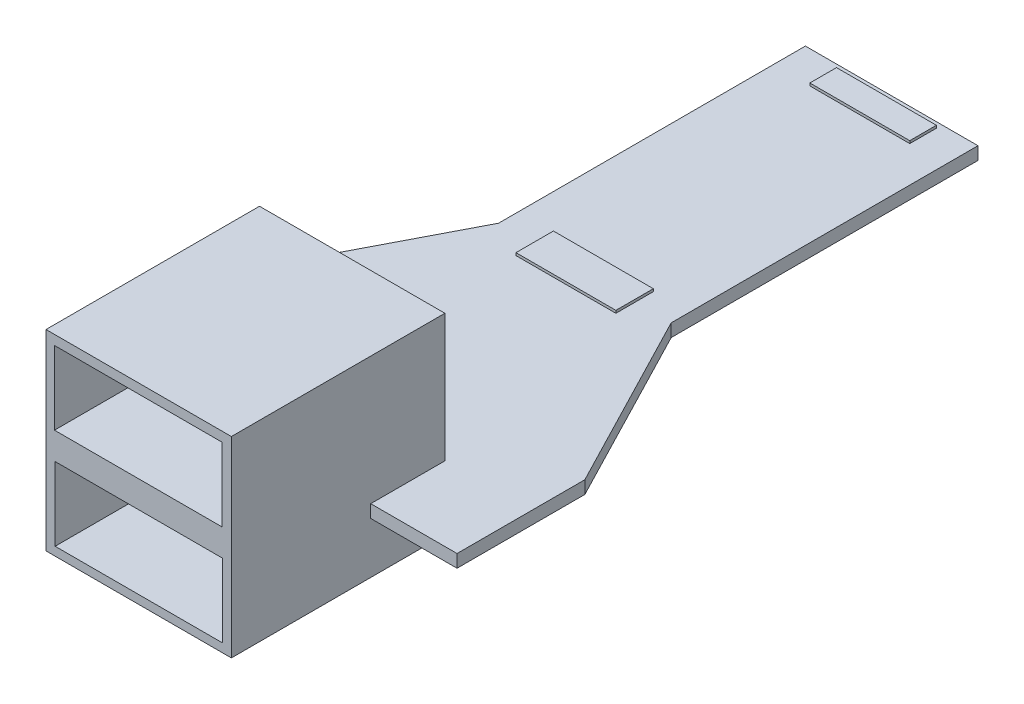
ISO-10303-21;
HEADER;
FILE_DESCRIPTION(('STEP AP214'),'2;1');
FILE_NAME('part.step','',(''),(''),'','','');
FILE_SCHEMA(('AUTOMOTIVE_DESIGN { 1 0 10303 214 1 1 1 1 }'));
ENDSEC;
DATA;
#1=APPLICATION_CONTEXT('core data for automotive mechanical design processes');
#2=APPLICATION_PROTOCOL_DEFINITION('international standard','automotive_design',2000,#1);
#3=PRODUCT_CONTEXT('',#1,'mechanical');
#4=PRODUCT('Part','Part','',(#3));
#5=PRODUCT_RELATED_PRODUCT_CATEGORY('part','',(#4));
#6=PRODUCT_DEFINITION_FORMATION('','',#4);
#7=PRODUCT_DEFINITION_CONTEXT('part definition',#1,'design');
#8=PRODUCT_DEFINITION('design','',#6,#7);
#9=PRODUCT_DEFINITION_SHAPE('','',#8);
#10=(LENGTH_UNIT() NAMED_UNIT(*) SI_UNIT(.MILLI.,.METRE.));
#11=(NAMED_UNIT(*) PLANE_ANGLE_UNIT() SI_UNIT($,.RADIAN.));
#12=(NAMED_UNIT(*) SI_UNIT($,.STERADIAN.) SOLID_ANGLE_UNIT());
#13=UNCERTAINTY_MEASURE_WITH_UNIT(LENGTH_MEASURE(1.E-05),#10,'distance_accuracy_value','');
#14=(GEOMETRIC_REPRESENTATION_CONTEXT(3) GLOBAL_UNCERTAINTY_ASSIGNED_CONTEXT((#13)) GLOBAL_UNIT_ASSIGNED_CONTEXT((#10,
#11,#12)) REPRESENTATION_CONTEXT('',''));
#15=CARTESIAN_POINT('',(0.,0.,0.));
#16=DIRECTION('',(0.,0.,1.));
#17=DIRECTION('',(1.,0.,0.));
#18=AXIS2_PLACEMENT_3D('',#15,#16,#17);
#19=CARTESIAN_POINT('',(0.,1.,0.));
#20=DIRECTION('',(0.,1.,0.));
#21=DIRECTION('',(0.,0.,1.));
#22=AXIS2_PLACEMENT_3D('',#19,#20,#21);
#23=PLANE('',#22);
#24=DIRECTION('',(0.,0.,1.));
#25=VECTOR('',#24,1.);
#26=CARTESIAN_POINT('',(-5.39699570815451,1.,0.));
#27=LINE('',#26,#25);
#28=CARTESIAN_POINT('',(-5.39699570815451,1.,2.45751072961373));
#29=VERTEX_POINT('',#28);
#30=CARTESIAN_POINT('',(-5.39699570815451,1.,8.25751072961373));
#31=VERTEX_POINT('',#30);
#32=EDGE_CURVE('E410',#29,#31,#27,.T.);
#33=ORIENTED_EDGE('',*,*,#32,.F.);
#34=DIRECTION('',(-1.,0.,0.));
#35=VECTOR('',#34,1.);
#36=CARTESIAN_POINT('',(0.,1.,2.45751072961373));
#37=LINE('',#36,#35);
#38=CARTESIAN_POINT('',(9.10300429184549,1.,2.45751072961373));
#39=VERTEX_POINT('',#38);
#40=EDGE_CURVE('E405',#39,#29,#37,.T.);
#41=ORIENTED_EDGE('',*,*,#40,.F.);
#42=DIRECTION('',(0.,0.,-1.));
#43=VECTOR('',#42,1.);
#44=CARTESIAN_POINT('',(9.10300429184549,1.,0.));
#45=LINE('',#44,#43);
#46=CARTESIAN_POINT('',(9.10300429184549,1.,8.25751072961373));
#47=VERTEX_POINT('',#46);
#48=EDGE_CURVE('E403',#47,#39,#45,.T.);
#49=ORIENTED_EDGE('',*,*,#48,.F.);
#50=DIRECTION('',(1.,0.,0.));
#51=VECTOR('',#50,1.);
#52=CARTESIAN_POINT('',(0.,1.,8.25751072961373));
#53=LINE('',#52,#51);
#54=CARTESIAN_POINT('',(15.8530042918455,1.,8.25751072961373));
#55=VERTEX_POINT('',#54);
#56=EDGE_CURVE('E429',#47,#55,#53,.T.);
#57=ORIENTED_EDGE('',*,*,#56,.T.);
#58=DIRECTION('',(0.,0.,1.));
#59=VECTOR('',#58,1.);
#60=CARTESIAN_POINT('',(15.8530042918455,1.,0.));
#61=LINE('',#60,#59);
#62=CARTESIAN_POINT('',(15.8530042918455,1.,-1.74248927038627));
#63=VERTEX_POINT('',#62);
#64=EDGE_CURVE('E433',#63,#55,#61,.T.);
#65=ORIENTED_EDGE('',*,*,#64,.F.);
#66=DIRECTION('',(0.459854247661453,0.,0.887994409277288));
#67=VECTOR('',#66,1.);
#68=CARTESIAN_POINT('',(13.2121760207027,1.,-6.84201972500677));
#69=LINE('',#68,#67);
#70=CARTESIAN_POINT('',(8.60300429184549,1.,-15.7424892703863));
#71=VERTEX_POINT('',#70);
#72=EDGE_CURVE('E413',#71,#63,#69,.T.);
#73=ORIENTED_EDGE('',*,*,#72,.F.);
#74=DIRECTION('',(0.,0.,1.));
#75=VECTOR('',#74,1.);
#76=CARTESIAN_POINT('',(8.6030042918455,1.,0.));
#77=LINE('',#76,#75);
#78=CARTESIAN_POINT('',(8.60300429184549,1.,-39.7424892703863));
#79=VERTEX_POINT('',#78);
#80=EDGE_CURVE('E416',#79,#71,#77,.T.);
#81=ORIENTED_EDGE('',*,*,#80,.F.);
#82=DIRECTION('',(1.,0.,0.));
#83=VECTOR('',#82,1.);
#84=CARTESIAN_POINT('',(0.,1.,-39.7424892703863));
#85=LINE('',#84,#83);
#86=CARTESIAN_POINT('',(-4.89699570815451,1.,-39.7424892703863));
#87=VERTEX_POINT('',#86);
#88=EDGE_CURVE('E420',#87,#79,#85,.T.);
#89=ORIENTED_EDGE('',*,*,#88,.F.);
#90=DIRECTION('',(0.,0.,1.));
#91=VECTOR('',#90,1.);
#92=CARTESIAN_POINT('',(-4.89699570815451,1.,0.));
#93=LINE('',#92,#91);
#94=CARTESIAN_POINT('',(-4.89699570815451,1.,-15.7424892703863));
#95=VERTEX_POINT('',#94);
#96=EDGE_CURVE('E423',#87,#95,#93,.T.);
#97=ORIENTED_EDGE('',*,*,#96,.T.);
#98=DIRECTION('',(-0.459854247661453,0.,0.887994409277288));
#99=VECTOR('',#98,1.);
#100=CARTESIAN_POINT('',(-10.2898619853859,1.,-5.32867852814628));
#101=LINE('',#100,#99);
#102=CARTESIAN_POINT('',(-12.1469957081545,1.,-1.74248927038627));
#103=VERTEX_POINT('',#102);
#104=EDGE_CURVE('E425',#95,#103,#101,.T.);
#105=ORIENTED_EDGE('',*,*,#104,.T.);
#106=DIRECTION('',(0.,0.,1.));
#107=VECTOR('',#106,1.);
#108=CARTESIAN_POINT('',(-12.1469957081545,1.,0.));
#109=LINE('',#108,#107);
#110=CARTESIAN_POINT('',(-12.1469957081545,1.,8.25751072961373));
#111=VERTEX_POINT('',#110);
#112=EDGE_CURVE('E427',#103,#111,#109,.T.);
#113=ORIENTED_EDGE('',*,*,#112,.T.);
#114=EDGE_CURVE('E430',#111,#31,#53,.T.);
#115=ORIENTED_EDGE('',*,*,#114,.T.);
#116=EDGE_LOOP('',(#33,#41,#49,#57,#65,#73,#81,#89,#97,#105,#113,#115));
#117=FACE_BOUND('',#116,.T.);
#118=DIRECTION('',(1.,0.,0.));
#119=VECTOR('',#118,1.);
#120=CARTESIAN_POINT('',(-2.02174192017821,1.,-14.2276042435795));
#121=LINE('',#120,#119);
#122=CARTESIAN_POINT('',(-2.02174192017821,1.,-14.2276042435795));
#123=VERTEX_POINT('',#122);
#124=CARTESIAN_POINT('',(5.79287228894523,1.,-14.2276042435795));
#125=VERTEX_POINT('',#124);
#126=EDGE_CURVE('E273',#123,#125,#121,.T.);
#127=ORIENTED_EDGE('',*,*,#126,.F.);
#128=DIRECTION('',(0.,0.,1.));
#129=VECTOR('',#128,1.);
#130=CARTESIAN_POINT('',(-2.02174192017821,1.,-17.1580845720007));
#131=LINE('',#130,#129);
#132=CARTESIAN_POINT('',(-2.02174192017821,1.,-17.1580845720007));
#133=VERTEX_POINT('',#132);
#134=EDGE_CURVE('E270',#133,#123,#131,.T.);
#135=ORIENTED_EDGE('',*,*,#134,.F.);
#136=DIRECTION('',(-1.,0.,0.));
#137=VECTOR('',#136,1.);
#138=CARTESIAN_POINT('',(-2.02174192017821,1.,-17.1580845720007));
#139=LINE('',#138,#137);
#140=CARTESIAN_POINT('',(5.79287228894523,1.,-17.1580845720007));
#141=VERTEX_POINT('',#140);
#142=EDGE_CURVE('E282',#141,#133,#139,.T.);
#143=ORIENTED_EDGE('',*,*,#142,.F.);
#144=DIRECTION('',(0.,0.,-1.));
#145=VECTOR('',#144,1.);
#146=CARTESIAN_POINT('',(5.79287228894523,1.,-17.1580845720007));
#147=LINE('',#146,#145);
#148=EDGE_CURVE('E290',#125,#141,#147,.T.);
#149=ORIENTED_EDGE('',*,*,#148,.F.);
#150=EDGE_LOOP('',(#127,#135,#143,#149));
#151=FACE_BOUND('',#150,.T.);
#152=DIRECTION('',(1.,0.,0.));
#153=VECTOR('',#152,1.);
#154=CARTESIAN_POINT('',(-2.02174192017821,1.,-37.2155943754176));
#155=LINE('',#154,#153);
#156=CARTESIAN_POINT('',(-2.02174192017821,1.,-37.2155943754176));
#157=VERTEX_POINT('',#156);
#158=CARTESIAN_POINT('',(5.79287228894523,1.,-37.2155943754176));
#159=VERTEX_POINT('',#158);
#160=EDGE_CURVE('E861',#157,#159,#155,.T.);
#161=ORIENTED_EDGE('',*,*,#160,.F.);
#162=DIRECTION('',(0.,0.,1.));
#163=VECTOR('',#162,1.);
#164=CARTESIAN_POINT('',(-2.02174192017821,1.,-39.2994914978505));
#165=LINE('',#164,#163);
#166=CARTESIAN_POINT('',(-2.02174192017821,1.,-39.2994914978505));
#167=VERTEX_POINT('',#166);
#168=EDGE_CURVE('E268',#167,#157,#165,.T.);
#169=ORIENTED_EDGE('',*,*,#168,.F.);
#170=DIRECTION('',(-1.,0.,0.));
#171=VECTOR('',#170,1.);
#172=CARTESIAN_POINT('',(-2.02174192017821,1.,-39.2994914978505));
#173=LINE('',#172,#171);
#174=CARTESIAN_POINT('',(5.79287228894523,1.,-39.2994914978505));
#175=VERTEX_POINT('',#174);
#176=EDGE_CURVE('E264',#175,#167,#173,.T.);
#177=ORIENTED_EDGE('',*,*,#176,.F.);
#178=DIRECTION('',(0.,0.,-1.));
#179=VECTOR('',#178,1.);
#180=CARTESIAN_POINT('',(5.79287228894523,1.,-39.2994914978505));
#181=LINE('',#180,#179);
#182=EDGE_CURVE('E858',#159,#175,#181,.T.);
#183=ORIENTED_EDGE('',*,*,#182,.F.);
#184=EDGE_LOOP('',(#161,#169,#177,#183));
#185=FACE_BOUND('',#184,.T.);
#186=ADVANCED_FACE('F35',(#117,#151,#185),#23,.T.);
#187=CARTESIAN_POINT('',(0.,1.,8.25751072961373));
#188=DIRECTION('',(0.,0.,-1.));
#189=DIRECTION('',(-1.,0.,0.));
#190=AXIS2_PLACEMENT_3D('',#187,#188,#189);
#191=PLANE('',#190);
#192=DIRECTION('',(1.,0.,0.));
#193=VECTOR('',#192,1.);
#194=CARTESIAN_POINT('',(0.,0.,8.25751072961373));
#195=LINE('',#194,#193);
#196=CARTESIAN_POINT('',(-12.1469957081545,0.,8.25751072961373));
#197=VERTEX_POINT('',#196);
#198=CARTESIAN_POINT('',(-5.39699570815451,0.,8.25751072961373));
#199=VERTEX_POINT('',#198);
#200=EDGE_CURVE('E452',#197,#199,#195,.T.);
#201=ORIENTED_EDGE('',*,*,#200,.T.);
#202=DIRECTION('',(0.,1.,0.));
#203=VECTOR('',#202,1.);
#204=CARTESIAN_POINT('',(-5.39699570815451,1.,8.25751072961373));
#205=LINE('',#204,#203);
#206=EDGE_CURVE('E407',#199,#31,#205,.T.);
#207=ORIENTED_EDGE('',*,*,#206,.T.);
#208=ORIENTED_EDGE('',*,*,#114,.F.);
#209=DIRECTION('',(0.,-1.,0.));
#210=VECTOR('',#209,1.);
#211=CARTESIAN_POINT('',(-12.1469957081545,1.,8.25751072961373));
#212=LINE('',#211,#210);
#213=EDGE_CURVE('E461',#111,#197,#212,.T.);
#214=ORIENTED_EDGE('',*,*,#213,.T.);
#215=EDGE_LOOP('',(#201,#207,#208,#214));
#216=FACE_BOUND('',#215,.T.);
#217=ADVANCED_FACE('F514',(#216),#191,.F.);
#218=CARTESIAN_POINT('',(13.2121760207027,1.,-6.84201972500677));
#219=DIRECTION('',(0.887994409277288,0.,-0.459854247661453));
#220=DIRECTION('',(-0.459854247661453,0.,-0.887994409277288));
#221=AXIS2_PLACEMENT_3D('',#218,#219,#220);
#222=PLANE('',#221);
#223=DIRECTION('',(0.459854247661453,0.,0.887994409277288));
#224=VECTOR('',#223,1.);
#225=CARTESIAN_POINT('',(13.2121760207027,0.,-6.84201972500677));
#226=LINE('',#225,#224);
#227=CARTESIAN_POINT('',(8.60300429184549,0.,-15.7424892703863));
#228=VERTEX_POINT('',#227);
#229=CARTESIAN_POINT('',(15.8530042918455,0.,-1.74248927038627));
#230=VERTEX_POINT('',#229);
#231=EDGE_CURVE('E412',#228,#230,#226,.T.);
#232=ORIENTED_EDGE('',*,*,#231,.F.);
#233=DIRECTION('',(0.,-1.,0.));
#234=VECTOR('',#233,1.);
#235=CARTESIAN_POINT('',(8.60300429184549,1.,-15.7424892703863));
#236=LINE('',#235,#234);
#237=EDGE_CURVE('E474',#71,#228,#236,.T.);
#238=ORIENTED_EDGE('',*,*,#237,.F.);
#239=ORIENTED_EDGE('',*,*,#72,.T.);
#240=DIRECTION('',(0.,-1.,0.));
#241=VECTOR('',#240,1.);
#242=CARTESIAN_POINT('',(15.8530042918455,1.,-1.74248927038627));
#243=LINE('',#242,#241);
#244=EDGE_CURVE('E436',#63,#230,#243,.T.);
#245=ORIENTED_EDGE('',*,*,#244,.T.);
#246=EDGE_LOOP('',(#232,#238,#239,#245));
#247=FACE_BOUND('',#246,.T.);
#248=ADVANCED_FACE('F37',(#247),#222,.T.);
#249=CARTESIAN_POINT('',(8.6030042918455,1.,0.));
#250=DIRECTION('',(1.,0.,0.));
#251=DIRECTION('',(0.,0.,-1.));
#252=AXIS2_PLACEMENT_3D('',#249,#250,#251);
#253=PLANE('',#252);
#254=DIRECTION('',(0.,0.,1.));
#255=VECTOR('',#254,1.);
#256=CARTESIAN_POINT('',(8.6030042918455,0.,0.));
#257=LINE('',#256,#255);
#258=CARTESIAN_POINT('',(8.60300429184549,0.,-39.7424892703863));
#259=VERTEX_POINT('',#258);
#260=EDGE_CURVE('E439',#259,#228,#257,.T.);
#261=ORIENTED_EDGE('',*,*,#260,.F.);
#262=DIRECTION('',(0.,-1.,0.));
#263=VECTOR('',#262,1.);
#264=CARTESIAN_POINT('',(8.60300429184549,1.,-39.7424892703863));
#265=LINE('',#264,#263);
#266=EDGE_CURVE('E472',#79,#259,#265,.T.);
#267=ORIENTED_EDGE('',*,*,#266,.F.);
#268=ORIENTED_EDGE('',*,*,#80,.T.);
#269=ORIENTED_EDGE('',*,*,#237,.T.);
#270=EDGE_LOOP('',(#261,#267,#268,#269));
#271=FACE_BOUND('',#270,.T.);
#272=ADVANCED_FACE('F537',(#271),#253,.T.);
#273=CARTESIAN_POINT('',(0.,1.,-39.7424892703863));
#274=DIRECTION('',(0.,0.,-1.));
#275=DIRECTION('',(-1.,0.,0.));
#276=AXIS2_PLACEMENT_3D('',#273,#274,#275);
#277=PLANE('',#276);
#278=DIRECTION('',(1.,0.,0.));
#279=VECTOR('',#278,1.);
#280=CARTESIAN_POINT('',(0.,0.,-39.7424892703863));
#281=LINE('',#280,#279);
#282=CARTESIAN_POINT('',(-4.89699570815451,0.,-39.7424892703863));
#283=VERTEX_POINT('',#282);
#284=EDGE_CURVE('E442',#283,#259,#281,.T.);
#285=ORIENTED_EDGE('',*,*,#284,.F.);
#286=DIRECTION('',(0.,-1.,0.));
#287=VECTOR('',#286,1.);
#288=CARTESIAN_POINT('',(-4.89699570815451,1.,-39.7424892703863));
#289=LINE('',#288,#287);
#290=EDGE_CURVE('E470',#87,#283,#289,.T.);
#291=ORIENTED_EDGE('',*,*,#290,.F.);
#292=ORIENTED_EDGE('',*,*,#88,.T.);
#293=ORIENTED_EDGE('',*,*,#266,.T.);
#294=EDGE_LOOP('',(#285,#291,#292,#293));
#295=FACE_BOUND('',#294,.T.);
#296=ADVANCED_FACE('F533',(#295),#277,.T.);
#297=CARTESIAN_POINT('',(-4.89699570815451,1.,0.));
#298=DIRECTION('',(1.,0.,0.));
#299=DIRECTION('',(0.,0.,-1.));
#300=AXIS2_PLACEMENT_3D('',#297,#298,#299);
#301=PLANE('',#300);
#302=DIRECTION('',(0.,0.,1.));
#303=VECTOR('',#302,1.);
#304=CARTESIAN_POINT('',(-4.89699570815451,0.,0.));
#305=LINE('',#304,#303);
#306=CARTESIAN_POINT('',(-4.89699570815451,0.,-15.7424892703863));
#307=VERTEX_POINT('',#306);
#308=EDGE_CURVE('E445',#283,#307,#305,.T.);
#309=ORIENTED_EDGE('',*,*,#308,.T.);
#310=DIRECTION('',(0.,-1.,0.));
#311=VECTOR('',#310,1.);
#312=CARTESIAN_POINT('',(-4.89699570815451,1.,-15.7424892703863));
#313=LINE('',#312,#311);
#314=EDGE_CURVE('E467',#95,#307,#313,.T.);
#315=ORIENTED_EDGE('',*,*,#314,.F.);
#316=ORIENTED_EDGE('',*,*,#96,.F.);
#317=ORIENTED_EDGE('',*,*,#290,.T.);
#318=EDGE_LOOP('',(#309,#315,#316,#317));
#319=FACE_BOUND('',#318,.T.);
#320=ADVANCED_FACE('F529',(#319),#301,.F.);
#321=CARTESIAN_POINT('',(-10.2898619853859,1.,-5.32867852814628));
#322=DIRECTION('',(0.887994409277288,0.,0.459854247661452));
#323=DIRECTION('',(0.459854247661452,0.,-0.887994409277288));
#324=AXIS2_PLACEMENT_3D('',#321,#322,#323);
#325=PLANE('',#324);
#326=DIRECTION('',(-0.459854247661453,0.,0.887994409277288));
#327=VECTOR('',#326,1.);
#328=CARTESIAN_POINT('',(-10.2898619853859,0.,-5.32867852814628));
#329=LINE('',#328,#327);
#330=CARTESIAN_POINT('',(-12.1469957081545,0.,-1.74248927038627));
#331=VERTEX_POINT('',#330);
#332=EDGE_CURVE('E447',#307,#331,#329,.T.);
#333=ORIENTED_EDGE('',*,*,#332,.T.);
#334=DIRECTION('',(0.,-1.,0.));
#335=VECTOR('',#334,1.);
#336=CARTESIAN_POINT('',(-12.1469957081545,1.,-1.74248927038627));
#337=LINE('',#336,#335);
#338=EDGE_CURVE('E464',#103,#331,#337,.T.);
#339=ORIENTED_EDGE('',*,*,#338,.F.);
#340=ORIENTED_EDGE('',*,*,#104,.F.);
#341=ORIENTED_EDGE('',*,*,#314,.T.);
#342=EDGE_LOOP('',(#333,#339,#340,#341));
#343=FACE_BOUND('',#342,.T.);
#344=ADVANCED_FACE('F525',(#343),#325,.F.);
#345=CARTESIAN_POINT('',(-12.1469957081545,1.,0.));
#346=DIRECTION('',(1.,0.,0.));
#347=DIRECTION('',(0.,0.,-1.));
#348=AXIS2_PLACEMENT_3D('',#345,#346,#347);
#349=PLANE('',#348);
#350=DIRECTION('',(0.,0.,1.));
#351=VECTOR('',#350,1.);
#352=CARTESIAN_POINT('',(-12.1469957081545,0.,0.));
#353=LINE('',#352,#351);
#354=EDGE_CURVE('E449',#331,#197,#353,.T.);
#355=ORIENTED_EDGE('',*,*,#354,.T.);
#356=ORIENTED_EDGE('',*,*,#213,.F.);
#357=ORIENTED_EDGE('',*,*,#112,.F.);
#358=ORIENTED_EDGE('',*,*,#338,.T.);
#359=EDGE_LOOP('',(#355,#356,#357,#358));
#360=FACE_BOUND('',#359,.T.);
#361=ADVANCED_FACE('F520',(#360),#349,.F.);
#362=ORIENTED_EDGE('',*,*,#56,.F.);
#363=DIRECTION('',(0.,-1.,0.));
#364=VECTOR('',#363,1.);
#365=CARTESIAN_POINT('',(9.10300429184549,1.,8.25751072961373));
#366=LINE('',#365,#364);
#367=CARTESIAN_POINT('',(9.10300429184549,0.,8.25751072961373));
#368=VERTEX_POINT('',#367);
#369=EDGE_CURVE('E393',#47,#368,#366,.T.);
#370=ORIENTED_EDGE('',*,*,#369,.T.);
#371=CARTESIAN_POINT('',(15.8530042918455,0.,8.25751072961373));
#372=VERTEX_POINT('',#371);
#373=EDGE_CURVE('E451',#368,#372,#195,.T.);
#374=ORIENTED_EDGE('',*,*,#373,.T.);
#375=DIRECTION('',(0.,-1.,0.));
#376=VECTOR('',#375,1.);
#377=CARTESIAN_POINT('',(15.8530042918455,1.,8.25751072961373));
#378=LINE('',#377,#376);
#379=EDGE_CURVE('E458',#55,#372,#378,.T.);
#380=ORIENTED_EDGE('',*,*,#379,.F.);
#381=EDGE_LOOP('',(#362,#370,#374,#380));
#382=FACE_BOUND('',#381,.T.);
#383=ADVANCED_FACE('F546',(#382),#191,.F.);
#384=CARTESIAN_POINT('',(15.8530042918455,1.,0.));
#385=DIRECTION('',(1.,0.,0.));
#386=DIRECTION('',(0.,0.,-1.));
#387=AXIS2_PLACEMENT_3D('',#384,#385,#386);
#388=PLANE('',#387);
#389=DIRECTION('',(0.,0.,1.));
#390=VECTOR('',#389,1.);
#391=CARTESIAN_POINT('',(15.8530042918455,0.,0.));
#392=LINE('',#391,#390);
#393=EDGE_CURVE('E417',#230,#372,#392,.T.);
#394=ORIENTED_EDGE('',*,*,#393,.F.);
#395=ORIENTED_EDGE('',*,*,#244,.F.);
#396=ORIENTED_EDGE('',*,*,#64,.T.);
#397=ORIENTED_EDGE('',*,*,#379,.T.);
#398=EDGE_LOOP('',(#394,#395,#396,#397));
#399=FACE_BOUND('',#398,.T.);
#400=ADVANCED_FACE('F542',(#399),#388,.T.);
#401=CARTESIAN_POINT('',(0.,0.,0.));
#402=DIRECTION('',(0.,1.,0.));
#403=DIRECTION('',(0.,0.,1.));
#404=AXIS2_PLACEMENT_3D('',#401,#402,#403);
#405=PLANE('',#404);
#406=DIRECTION('',(-1.,0.,0.));
#407=VECTOR('',#406,1.);
#408=CARTESIAN_POINT('',(0.,0.,2.45751072961373));
#409=LINE('',#408,#407);
#410=CARTESIAN_POINT('',(9.10300429184549,0.,2.45751072961373));
#411=VERTEX_POINT('',#410);
#412=CARTESIAN_POINT('',(-5.39699570815451,0.,2.45751072961373));
#413=VERTEX_POINT('',#412);
#414=EDGE_CURVE('E43',#411,#413,#409,.T.);
#415=ORIENTED_EDGE('',*,*,#414,.T.);
#416=DIRECTION('',(0.,0.,1.));
#417=VECTOR('',#416,1.);
#418=CARTESIAN_POINT('',(-5.39699570815451,0.,0.));
#419=LINE('',#418,#417);
#420=EDGE_CURVE('E11',#413,#199,#419,.T.);
#421=ORIENTED_EDGE('',*,*,#420,.T.);
#422=ORIENTED_EDGE('',*,*,#200,.F.);
#423=ORIENTED_EDGE('',*,*,#354,.F.);
#424=ORIENTED_EDGE('',*,*,#332,.F.);
#425=ORIENTED_EDGE('',*,*,#308,.F.);
#426=ORIENTED_EDGE('',*,*,#284,.T.);
#427=ORIENTED_EDGE('',*,*,#260,.T.);
#428=ORIENTED_EDGE('',*,*,#231,.T.);
#429=ORIENTED_EDGE('',*,*,#393,.T.);
#430=ORIENTED_EDGE('',*,*,#373,.F.);
#431=DIRECTION('',(0.,0.,-1.));
#432=VECTOR('',#431,1.);
#433=CARTESIAN_POINT('',(9.10300429184549,0.,0.));
#434=LINE('',#433,#432);
#435=EDGE_CURVE('E476',#368,#411,#434,.T.);
#436=ORIENTED_EDGE('',*,*,#435,.T.);
#437=EDGE_LOOP('',(#415,#421,#422,#423,#424,#425,#426,#427,#428,#429,#430,#436));
#438=FACE_BOUND('',#437,.T.);
#439=ADVANCED_FACE('F481',(#438),#405,.F.);
#440=CARTESIAN_POINT('',(-5.39699570815451,-4.00000000000001,2.45751072961373));
#441=DIRECTION('',(0.,0.,-1.));
#442=DIRECTION('',(-1.,0.,0.));
#443=AXIS2_PLACEMENT_3D('',#440,#441,#442);
#444=PLANE('',#443);
#445=ORIENTED_EDGE('',*,*,#414,.F.);
#446=DIRECTION('',(0.,1.,0.));
#447=VECTOR('',#446,1.);
#448=CARTESIAN_POINT('',(9.10300429184549,-4.00000000000001,2.45751072961373));
#449=LINE('',#448,#447);
#450=CARTESIAN_POINT('',(9.10300429184549,-4.00000000000001,2.45751072961373));
#451=VERTEX_POINT('',#450);
#452=EDGE_CURVE('E395',#451,#411,#449,.T.);
#453=ORIENTED_EDGE('',*,*,#452,.F.);
#454=DIRECTION('',(-1.,0.,0.));
#455=VECTOR('',#454,1.);
#456=CARTESIAN_POINT('',(-5.39699570815451,-4.00000000000001,2.45751072961373));
#457=LINE('',#456,#455);
#458=CARTESIAN_POINT('',(-5.39699570815451,-4.00000000000001,2.45751072961373));
#459=VERTEX_POINT('',#458);
#460=EDGE_CURVE('E376',#451,#459,#457,.T.);
#461=ORIENTED_EDGE('',*,*,#460,.T.);
#462=DIRECTION('',(0.,1.,0.));
#463=VECTOR('',#462,1.);
#464=CARTESIAN_POINT('',(-5.39699570815451,-4.00000000000001,2.45751072961373));
#465=LINE('',#464,#463);
#466=EDGE_CURVE('E390',#459,#413,#465,.T.);
#467=ORIENTED_EDGE('',*,*,#466,.T.);
#468=EDGE_LOOP('',(#445,#453,#461,#467));
#469=FACE_BOUND('',#468,.T.);
#470=ADVANCED_FACE('F485',(#469),#444,.T.);
#471=CARTESIAN_POINT('',(-5.39699570815451,-4.00000000000001,2.45751072961373));
#472=DIRECTION('',(-1.,0.,0.));
#473=DIRECTION('',(0.,0.,1.));
#474=AXIS2_PLACEMENT_3D('',#471,#472,#473);
#475=PLANE('',#474);
#476=CARTESIAN_POINT('',(-5.39699570815451,11.,2.45751072961373));
#477=VERTEX_POINT('',#476);
#478=EDGE_CURVE('E394',#29,#477,#465,.T.);
#479=ORIENTED_EDGE('',*,*,#478,.F.);
#480=ORIENTED_EDGE('',*,*,#32,.T.);
#481=ORIENTED_EDGE('',*,*,#206,.F.);
#482=ORIENTED_EDGE('',*,*,#420,.F.);
#483=ORIENTED_EDGE('',*,*,#466,.F.);
#484=DIRECTION('',(0.,0.,1.));
#485=VECTOR('',#484,1.);
#486=CARTESIAN_POINT('',(-5.39699570815451,-4.00000000000001,2.45751072961373));
#487=LINE('',#486,#485);
#488=CARTESIAN_POINT('',(-5.3969957081545,-4.00000000000001,19.1575107296137));
#489=VERTEX_POINT('',#488);
#490=EDGE_CURVE('E366',#459,#489,#487,.T.);
#491=ORIENTED_EDGE('',*,*,#490,.T.);
#492=DIRECTION('',(0.,1.,0.));
#493=VECTOR('',#492,1.);
#494=CARTESIAN_POINT('',(-5.3969957081545,-4.00000000000001,19.1575107296137));
#495=LINE('',#494,#493);
#496=CARTESIAN_POINT('',(-5.3969957081545,11.,19.1575107296137));
#497=VERTEX_POINT('',#496);
#498=EDGE_CURVE('E379',#489,#497,#495,.T.);
#499=ORIENTED_EDGE('',*,*,#498,.T.);
#500=DIRECTION('',(0.,0.,1.));
#501=VECTOR('',#500,1.);
#502=CARTESIAN_POINT('',(-5.39699570815451,11.,2.45751072961373));
#503=LINE('',#502,#501);
#504=EDGE_CURVE('E329',#477,#497,#503,.T.);
#505=ORIENTED_EDGE('',*,*,#504,.F.);
#506=EDGE_LOOP('',(#479,#480,#481,#482,#483,#491,#499,#505));
#507=FACE_BOUND('',#506,.T.);
#508=ADVANCED_FACE('F490',(#507),#475,.T.);
#509=CARTESIAN_POINT('',(9.10300429184549,11.,2.45751072961373));
#510=VERTEX_POINT('',#509);
#511=EDGE_CURVE('E397',#39,#510,#449,.T.);
#512=ORIENTED_EDGE('',*,*,#511,.F.);
#513=ORIENTED_EDGE('',*,*,#40,.T.);
#514=ORIENTED_EDGE('',*,*,#478,.T.);
#515=DIRECTION('',(-1.,0.,0.));
#516=VECTOR('',#515,1.);
#517=CARTESIAN_POINT('',(-5.39699570815451,11.,2.45751072961373));
#518=LINE('',#517,#516);
#519=EDGE_CURVE('E370',#510,#477,#518,.T.);
#520=ORIENTED_EDGE('',*,*,#519,.F.);
#521=EDGE_LOOP('',(#512,#513,#514,#520));
#522=FACE_BOUND('',#521,.T.);
#523=ADVANCED_FACE('F506',(#522),#444,.T.);
#524=CARTESIAN_POINT('',(9.10300429184549,-4.00000000000001,2.45751072961373));
#525=DIRECTION('',(1.,0.,0.));
#526=DIRECTION('',(0.,0.,-1.));
#527=AXIS2_PLACEMENT_3D('',#524,#525,#526);
#528=PLANE('',#527);
#529=ORIENTED_EDGE('',*,*,#369,.F.);
#530=ORIENTED_EDGE('',*,*,#48,.T.);
#531=ORIENTED_EDGE('',*,*,#511,.T.);
#532=DIRECTION('',(0.,0.,-1.));
#533=VECTOR('',#532,1.);
#534=CARTESIAN_POINT('',(9.10300429184549,11.,2.45751072961373));
#535=LINE('',#534,#533);
#536=CARTESIAN_POINT('',(9.1030042918455,11.,19.1575107296137));
#537=VERTEX_POINT('',#536);
#538=EDGE_CURVE('E385',#537,#510,#535,.T.);
#539=ORIENTED_EDGE('',*,*,#538,.F.);
#540=DIRECTION('',(0.,1.,0.));
#541=VECTOR('',#540,1.);
#542=CARTESIAN_POINT('',(9.1030042918455,-4.00000000000001,19.1575107296137));
#543=LINE('',#542,#541);
#544=CARTESIAN_POINT('',(9.1030042918455,-4.00000000000001,19.1575107296137));
#545=VERTEX_POINT('',#544);
#546=EDGE_CURVE('E398',#545,#537,#543,.T.);
#547=ORIENTED_EDGE('',*,*,#546,.F.);
#548=DIRECTION('',(0.,0.,-1.));
#549=VECTOR('',#548,1.);
#550=CARTESIAN_POINT('',(9.10300429184549,-4.00000000000001,2.45751072961373));
#551=LINE('',#550,#549);
#552=EDGE_CURVE('E373',#545,#451,#551,.T.);
#553=ORIENTED_EDGE('',*,*,#552,.T.);
#554=ORIENTED_EDGE('',*,*,#452,.T.);
#555=ORIENTED_EDGE('',*,*,#435,.F.);
#556=EDGE_LOOP('',(#529,#530,#531,#539,#547,#553,#554,#555));
#557=FACE_BOUND('',#556,.T.);
#558=ADVANCED_FACE('F548',(#557),#528,.T.);
#559=CARTESIAN_POINT('',(-5.3969957081545,-4.00000000000001,19.1575107296137));
#560=DIRECTION('',(0.,0.,1.));
#561=DIRECTION('',(1.,0.,0.));
#562=AXIS2_PLACEMENT_3D('',#559,#560,#561);
#563=PLANE('',#562);
#564=DIRECTION('',(0.,-1.,0.));
#565=VECTOR('',#564,1.);
#566=CARTESIAN_POINT('',(-4.73343217296478,10.2507813286157,19.1575107296137));
#567=LINE('',#566,#565);
#568=CARTESIAN_POINT('',(-4.73343217296478,10.2507813286157,19.1575107296137));
#569=VERTEX_POINT('',#568);
#570=CARTESIAN_POINT('',(-4.73343217296478,4.51078132861573,19.1575107296137));
#571=VERTEX_POINT('',#570);
#572=EDGE_CURVE('E316',#569,#571,#567,.T.);
#573=ORIENTED_EDGE('',*,*,#572,.F.);
#574=DIRECTION('',(-1.,0.,0.));
#575=VECTOR('',#574,1.);
#576=CARTESIAN_POINT('',(-4.73343217296478,10.2507813286157,19.1575107296137));
#577=LINE('',#576,#575);
#578=CARTESIAN_POINT('',(8.36656782703522,10.2507813286157,19.1575107296137));
#579=VERTEX_POINT('',#578);
#580=EDGE_CURVE('E306',#579,#569,#577,.T.);
#581=ORIENTED_EDGE('',*,*,#580,.F.);
#582=DIRECTION('',(0.,1.,0.));
#583=VECTOR('',#582,1.);
#584=CARTESIAN_POINT('',(8.36656782703522,10.2507813286157,19.1575107296137));
#585=LINE('',#584,#583);
#586=CARTESIAN_POINT('',(8.36656782703522,4.51078132861573,19.1575107296137));
#587=VERTEX_POINT('',#586);
#588=EDGE_CURVE('E322',#587,#579,#585,.T.);
#589=ORIENTED_EDGE('',*,*,#588,.F.);
#590=DIRECTION('',(1.,0.,0.));
#591=VECTOR('',#590,1.);
#592=CARTESIAN_POINT('',(-4.73343217296478,4.51078132861573,19.1575107296137));
#593=LINE('',#592,#591);
#594=EDGE_CURVE('E318',#571,#587,#593,.T.);
#595=ORIENTED_EDGE('',*,*,#594,.F.);
#596=EDGE_LOOP('',(#573,#581,#589,#595));
#597=FACE_BOUND('',#596,.T.);
#598=DIRECTION('',(0.,-1.,0.));
#599=VECTOR('',#598,1.);
#600=CARTESIAN_POINT('',(-4.68286452256317,2.4127955163655,19.1575107296137));
#601=LINE('',#600,#599);
#602=CARTESIAN_POINT('',(-4.68286452256317,2.4127955163655,19.1575107296137));
#603=VERTEX_POINT('',#602);
#604=CARTESIAN_POINT('',(-4.68286452256317,-3.3272044836345,19.1575107296137));
#605=VERTEX_POINT('',#604);
#606=EDGE_CURVE('E301',#603,#605,#601,.T.);
#607=ORIENTED_EDGE('',*,*,#606,.F.);
#608=DIRECTION('',(-1.,0.,0.));
#609=VECTOR('',#608,1.);
#610=CARTESIAN_POINT('',(-4.68286452256317,2.4127955163655,19.1575107296137));
#611=LINE('',#610,#609);
#612=CARTESIAN_POINT('',(8.41713547743683,2.4127955163655,19.1575107296137));
#613=VERTEX_POINT('',#612);
#614=EDGE_CURVE('E340',#613,#603,#611,.T.);
#615=ORIENTED_EDGE('',*,*,#614,.F.);
#616=DIRECTION('',(0.,1.,0.));
#617=VECTOR('',#616,1.);
#618=CARTESIAN_POINT('',(8.41713547743683,2.4127955163655,19.1575107296137));
#619=LINE('',#618,#617);
#620=CARTESIAN_POINT('',(8.41713547743683,-3.3272044836345,19.1575107296137));
#621=VERTEX_POINT('',#620);
#622=EDGE_CURVE('E354',#621,#613,#619,.T.);
#623=ORIENTED_EDGE('',*,*,#622,.F.);
#624=DIRECTION('',(1.,0.,0.));
#625=VECTOR('',#624,1.);
#626=CARTESIAN_POINT('',(-4.68286452256317,-3.3272044836345,19.1575107296137));
#627=LINE('',#626,#625);
#628=EDGE_CURVE('E351',#605,#621,#627,.T.);
#629=ORIENTED_EDGE('',*,*,#628,.F.);
#630=EDGE_LOOP('',(#607,#615,#623,#629));
#631=FACE_BOUND('',#630,.T.);
#632=DIRECTION('',(1.,0.,0.));
#633=VECTOR('',#632,1.);
#634=CARTESIAN_POINT('',(-5.3969957081545,11.,19.1575107296137));
#635=LINE('',#634,#633);
#636=EDGE_CURVE('E382',#497,#537,#635,.T.);
#637=ORIENTED_EDGE('',*,*,#636,.F.);
#638=ORIENTED_EDGE('',*,*,#498,.F.);
#639=DIRECTION('',(1.,0.,0.));
#640=VECTOR('',#639,1.);
#641=CARTESIAN_POINT('',(-5.3969957081545,-4.00000000000001,19.1575107296137));
#642=LINE('',#641,#640);
#643=EDGE_CURVE('E369',#489,#545,#642,.T.);
#644=ORIENTED_EDGE('',*,*,#643,.T.);
#645=ORIENTED_EDGE('',*,*,#546,.T.);
#646=EDGE_LOOP('',(#637,#638,#644,#645));
#647=FACE_BOUND('',#646,.T.);
#648=ADVANCED_FACE('F497',(#597,#631,#647),#563,.T.);
#649=CARTESIAN_POINT('',(0.,-4.00000000000001,0.));
#650=DIRECTION('',(0.,1.,0.));
#651=DIRECTION('',(0.,0.,1.));
#652=AXIS2_PLACEMENT_3D('',#649,#650,#651);
#653=PLANE('',#652);
#654=ORIENTED_EDGE('',*,*,#490,.F.);
#655=ORIENTED_EDGE('',*,*,#460,.F.);
#656=ORIENTED_EDGE('',*,*,#552,.F.);
#657=ORIENTED_EDGE('',*,*,#643,.F.);
#658=EDGE_LOOP('',(#654,#655,#656,#657));
#659=FACE_BOUND('',#658,.T.);
#660=ADVANCED_FACE('F493',(#659),#653,.F.);
#661=CARTESIAN_POINT('',(0.,11.,0.));
#662=DIRECTION('',(0.,1.,0.));
#663=DIRECTION('',(0.,0.,1.));
#664=AXIS2_PLACEMENT_3D('',#661,#662,#663);
#665=PLANE('',#664);
#666=ORIENTED_EDGE('',*,*,#504,.T.);
#667=ORIENTED_EDGE('',*,*,#636,.T.);
#668=ORIENTED_EDGE('',*,*,#538,.T.);
#669=ORIENTED_EDGE('',*,*,#519,.T.);
#670=EDGE_LOOP('',(#666,#667,#668,#669));
#671=FACE_BOUND('',#670,.T.);
#672=ADVANCED_FACE('F503',(#671),#665,.T.);
#673=CARTESIAN_POINT('',(-4.68286452256317,2.4127955163655,9.15751072961374));
#674=DIRECTION('',(-1.,0.,0.));
#675=DIRECTION('',(0.,-1.,0.));
#676=AXIS2_PLACEMENT_3D('',#673,#674,#675);
#677=PLANE('',#676);
#678=ORIENTED_EDGE('',*,*,#606,.T.);
#679=DIRECTION('',(0.,0.,1.));
#680=VECTOR('',#679,1.);
#681=CARTESIAN_POINT('',(-4.68286452256317,-3.3272044836345,9.15751072961374));
#682=LINE('',#681,#680);
#683=CARTESIAN_POINT('',(-4.68286452256317,-3.3272044836345,9.15751072961374));
#684=VERTEX_POINT('',#683);
#685=EDGE_CURVE('E349',#684,#605,#682,.T.);
#686=ORIENTED_EDGE('',*,*,#685,.F.);
#687=DIRECTION('',(0.,-1.,0.));
#688=VECTOR('',#687,1.);
#689=CARTESIAN_POINT('',(-4.68286452256317,2.4127955163655,9.15751072961374));
#690=LINE('',#689,#688);
#691=CARTESIAN_POINT('',(-4.68286452256317,2.4127955163655,9.15751072961374));
#692=VERTEX_POINT('',#691);
#693=EDGE_CURVE('E336',#692,#684,#690,.T.);
#694=ORIENTED_EDGE('',*,*,#693,.F.);
#695=DIRECTION('',(0.,0.,1.));
#696=VECTOR('',#695,1.);
#697=CARTESIAN_POINT('',(-4.68286452256317,2.4127955163655,9.15751072961374));
#698=LINE('',#697,#696);
#699=EDGE_CURVE('E319',#692,#603,#698,.T.);
#700=ORIENTED_EDGE('',*,*,#699,.T.);
#701=EDGE_LOOP('',(#678,#686,#694,#700));
#702=FACE_BOUND('',#701,.T.);
#703=ADVANCED_FACE('F648',(#702),#677,.F.);
#704=CARTESIAN_POINT('',(-4.68286452256317,2.4127955163655,9.15751072961374));
#705=DIRECTION('',(0.,1.,0.));
#706=DIRECTION('',(0.,0.,1.));
#707=AXIS2_PLACEMENT_3D('',#704,#705,#706);
#708=PLANE('',#707);
#709=ORIENTED_EDGE('',*,*,#614,.T.);
#710=ORIENTED_EDGE('',*,*,#699,.F.);
#711=DIRECTION('',(-1.,0.,0.));
#712=VECTOR('',#711,1.);
#713=CARTESIAN_POINT('',(-4.68286452256317,2.4127955163655,9.15751072961374));
#714=LINE('',#713,#712);
#715=CARTESIAN_POINT('',(8.41713547743683,2.4127955163655,9.15751072961374));
#716=VERTEX_POINT('',#715);
#717=EDGE_CURVE('E346',#716,#692,#714,.T.);
#718=ORIENTED_EDGE('',*,*,#717,.F.);
#719=DIRECTION('',(0.,0.,1.));
#720=VECTOR('',#719,1.);
#721=CARTESIAN_POINT('',(8.41713547743683,2.4127955163655,9.15751072961374));
#722=LINE('',#721,#720);
#723=EDGE_CURVE('E360',#716,#613,#722,.T.);
#724=ORIENTED_EDGE('',*,*,#723,.T.);
#725=EDGE_LOOP('',(#709,#710,#718,#724));
#726=FACE_BOUND('',#725,.T.);
#727=ADVANCED_FACE('F662',(#726),#708,.F.);
#728=CARTESIAN_POINT('',(8.41713547743683,2.4127955163655,9.15751072961374));
#729=DIRECTION('',(1.,0.,0.));
#730=DIRECTION('',(0.,0.,-1.));
#731=AXIS2_PLACEMENT_3D('',#728,#729,#730);
#732=PLANE('',#731);
#733=ORIENTED_EDGE('',*,*,#622,.T.);
#734=ORIENTED_EDGE('',*,*,#723,.F.);
#735=DIRECTION('',(0.,1.,0.));
#736=VECTOR('',#735,1.);
#737=CARTESIAN_POINT('',(8.41713547743683,2.4127955163655,9.15751072961374));
#738=LINE('',#737,#736);
#739=CARTESIAN_POINT('',(8.41713547743683,-3.3272044836345,9.15751072961374));
#740=VERTEX_POINT('',#739);
#741=EDGE_CURVE('E343',#740,#716,#738,.T.);
#742=ORIENTED_EDGE('',*,*,#741,.F.);
#743=DIRECTION('',(0.,0.,1.));
#744=VECTOR('',#743,1.);
#745=CARTESIAN_POINT('',(8.41713547743683,-3.3272044836345,9.15751072961374));
#746=LINE('',#745,#744);
#747=EDGE_CURVE('E362',#740,#621,#746,.T.);
#748=ORIENTED_EDGE('',*,*,#747,.T.);
#749=EDGE_LOOP('',(#733,#734,#742,#748));
#750=FACE_BOUND('',#749,.T.);
#751=ADVANCED_FACE('F672',(#750),#732,.F.);
#752=CARTESIAN_POINT('',(-4.68286452256317,-3.3272044836345,9.15751072961374));
#753=DIRECTION('',(0.,-1.,0.));
#754=DIRECTION('',(0.,0.,-1.));
#755=AXIS2_PLACEMENT_3D('',#752,#753,#754);
#756=PLANE('',#755);
#757=ORIENTED_EDGE('',*,*,#628,.T.);
#758=ORIENTED_EDGE('',*,*,#747,.F.);
#759=DIRECTION('',(1.,0.,0.));
#760=VECTOR('',#759,1.);
#761=CARTESIAN_POINT('',(-4.68286452256317,-3.3272044836345,9.15751072961374));
#762=LINE('',#761,#760);
#763=EDGE_CURVE('E339',#684,#740,#762,.T.);
#764=ORIENTED_EDGE('',*,*,#763,.F.);
#765=ORIENTED_EDGE('',*,*,#685,.T.);
#766=EDGE_LOOP('',(#757,#758,#764,#765));
#767=FACE_BOUND('',#766,.T.);
#768=ADVANCED_FACE('F682',(#767),#756,.F.);
#769=CARTESIAN_POINT('',(0.,0.,9.15751072961374));
#770=DIRECTION('',(0.,0.,1.));
#771=DIRECTION('',(1.,0.,0.));
#772=AXIS2_PLACEMENT_3D('',#769,#770,#771);
#773=PLANE('',#772);
#774=ORIENTED_EDGE('',*,*,#693,.T.);
#775=ORIENTED_EDGE('',*,*,#763,.T.);
#776=ORIENTED_EDGE('',*,*,#741,.T.);
#777=ORIENTED_EDGE('',*,*,#717,.T.);
#778=EDGE_LOOP('',(#774,#775,#776,#777));
#779=FACE_BOUND('',#778,.T.);
#780=ADVANCED_FACE('F692',(#779),#773,.T.);
#781=CARTESIAN_POINT('',(-4.73343217296478,10.2507813286157,9.15751072961374));
#782=DIRECTION('',(-1.,0.,0.));
#783=DIRECTION('',(0.,-1.,0.));
#784=AXIS2_PLACEMENT_3D('',#781,#782,#783);
#785=PLANE('',#784);
#786=ORIENTED_EDGE('',*,*,#572,.T.);
#787=DIRECTION('',(0.,0.,1.));
#788=VECTOR('',#787,1.);
#789=CARTESIAN_POINT('',(-4.73343217296478,4.51078132861573,9.15751072961374));
#790=LINE('',#789,#788);
#791=CARTESIAN_POINT('',(-4.73343217296478,4.51078132861573,9.15751072961374));
#792=VERTEX_POINT('',#791);
#793=EDGE_CURVE('E315',#792,#571,#790,.T.);
#794=ORIENTED_EDGE('',*,*,#793,.F.);
#795=DIRECTION('',(0.,-1.,0.));
#796=VECTOR('',#795,1.);
#797=CARTESIAN_POINT('',(-4.73343217296478,10.2507813286157,9.15751072961374));
#798=LINE('',#797,#796);
#799=CARTESIAN_POINT('',(-4.73343217296478,10.2507813286157,9.15751072961374));
#800=VERTEX_POINT('',#799);
#801=EDGE_CURVE('E302',#800,#792,#798,.T.);
#802=ORIENTED_EDGE('',*,*,#801,.F.);
#803=DIRECTION('',(0.,0.,1.));
#804=VECTOR('',#803,1.);
#805=CARTESIAN_POINT('',(-4.73343217296478,10.2507813286157,9.15751072961374));
#806=LINE('',#805,#804);
#807=EDGE_CURVE('E327',#800,#569,#806,.T.);
#808=ORIENTED_EDGE('',*,*,#807,.T.);
#809=EDGE_LOOP('',(#786,#794,#802,#808));
#810=FACE_BOUND('',#809,.T.);
#811=ADVANCED_FACE('F702',(#810),#785,.F.);
#812=CARTESIAN_POINT('',(-4.73343217296478,10.2507813286157,9.15751072961374));
#813=DIRECTION('',(0.,1.,0.));
#814=DIRECTION('',(0.,0.,1.));
#815=AXIS2_PLACEMENT_3D('',#812,#813,#814);
#816=PLANE('',#815);
#817=ORIENTED_EDGE('',*,*,#580,.T.);
#818=ORIENTED_EDGE('',*,*,#807,.F.);
#819=DIRECTION('',(-1.,0.,0.));
#820=VECTOR('',#819,1.);
#821=CARTESIAN_POINT('',(-4.73343217296478,10.2507813286157,9.15751072961374));
#822=LINE('',#821,#820);
#823=CARTESIAN_POINT('',(8.36656782703522,10.2507813286157,9.15751072961374));
#824=VERTEX_POINT('',#823);
#825=EDGE_CURVE('E312',#824,#800,#822,.T.);
#826=ORIENTED_EDGE('',*,*,#825,.F.);
#827=DIRECTION('',(0.,0.,1.));
#828=VECTOR('',#827,1.);
#829=CARTESIAN_POINT('',(8.36656782703522,10.2507813286157,9.15751072961374));
#830=LINE('',#829,#828);
#831=EDGE_CURVE('E330',#824,#579,#830,.T.);
#832=ORIENTED_EDGE('',*,*,#831,.T.);
#833=EDGE_LOOP('',(#817,#818,#826,#832));
#834=FACE_BOUND('',#833,.T.);
#835=ADVANCED_FACE('F712',(#834),#816,.F.);
#836=CARTESIAN_POINT('',(8.36656782703522,10.2507813286157,9.15751072961374));
#837=DIRECTION('',(1.,0.,0.));
#838=DIRECTION('',(0.,0.,-1.));
#839=AXIS2_PLACEMENT_3D('',#836,#837,#838);
#840=PLANE('',#839);
#841=ORIENTED_EDGE('',*,*,#588,.T.);
#842=ORIENTED_EDGE('',*,*,#831,.F.);
#843=DIRECTION('',(0.,1.,0.));
#844=VECTOR('',#843,1.);
#845=CARTESIAN_POINT('',(8.36656782703522,10.2507813286157,9.15751072961374));
#846=LINE('',#845,#844);
#847=CARTESIAN_POINT('',(8.36656782703522,4.51078132861573,9.15751072961374));
#848=VERTEX_POINT('',#847);
#849=EDGE_CURVE('E309',#848,#824,#846,.T.);
#850=ORIENTED_EDGE('',*,*,#849,.F.);
#851=DIRECTION('',(0.,0.,1.));
#852=VECTOR('',#851,1.);
#853=CARTESIAN_POINT('',(8.36656782703522,4.51078132861573,9.15751072961374));
#854=LINE('',#853,#852);
#855=EDGE_CURVE('E332',#848,#587,#854,.T.);
#856=ORIENTED_EDGE('',*,*,#855,.T.);
#857=EDGE_LOOP('',(#841,#842,#850,#856));
#858=FACE_BOUND('',#857,.T.);
#859=ADVANCED_FACE('F722',(#858),#840,.F.);
#860=CARTESIAN_POINT('',(-4.73343217296478,4.51078132861573,9.15751072961374));
#861=DIRECTION('',(0.,-1.,0.));
#862=DIRECTION('',(0.,0.,-1.));
#863=AXIS2_PLACEMENT_3D('',#860,#861,#862);
#864=PLANE('',#863);
#865=ORIENTED_EDGE('',*,*,#594,.T.);
#866=ORIENTED_EDGE('',*,*,#855,.F.);
#867=DIRECTION('',(1.,0.,0.));
#868=VECTOR('',#867,1.);
#869=CARTESIAN_POINT('',(-4.73343217296478,4.51078132861573,9.15751072961374));
#870=LINE('',#869,#868);
#871=EDGE_CURVE('E305',#792,#848,#870,.T.);
#872=ORIENTED_EDGE('',*,*,#871,.F.);
#873=ORIENTED_EDGE('',*,*,#793,.T.);
#874=EDGE_LOOP('',(#865,#866,#872,#873));
#875=FACE_BOUND('',#874,.T.);
#876=ADVANCED_FACE('F732',(#875),#864,.F.);
#877=CARTESIAN_POINT('',(0.,0.,9.15751072961374));
#878=DIRECTION('',(0.,0.,1.));
#879=DIRECTION('',(1.,0.,0.));
#880=AXIS2_PLACEMENT_3D('',#877,#878,#879);
#881=PLANE('',#880);
#882=ORIENTED_EDGE('',*,*,#801,.T.);
#883=ORIENTED_EDGE('',*,*,#871,.T.);
#884=ORIENTED_EDGE('',*,*,#849,.T.);
#885=ORIENTED_EDGE('',*,*,#825,.T.);
#886=EDGE_LOOP('',(#882,#883,#884,#885));
#887=FACE_BOUND('',#886,.T.);
#888=ADVANCED_FACE('F742',(#887),#881,.T.);
#889=CARTESIAN_POINT('',(-2.02174192017821,1.2,-17.1580845720007));
#890=DIRECTION('',(1.,0.,0.));
#891=DIRECTION('',(0.,0.,-1.));
#892=AXIS2_PLACEMENT_3D('',#889,#890,#891);
#893=PLANE('',#892);
#894=ORIENTED_EDGE('',*,*,#134,.T.);
#895=DIRECTION('',(0.,-1.,0.));
#896=VECTOR('',#895,1.);
#897=CARTESIAN_POINT('',(-2.02174192017821,1.2,-14.2276042435795));
#898=LINE('',#897,#896);
#899=CARTESIAN_POINT('',(-2.02174192017821,1.2,-14.2276042435795));
#900=VERTEX_POINT('',#899);
#901=EDGE_CURVE('E299',#900,#123,#898,.T.);
#902=ORIENTED_EDGE('',*,*,#901,.F.);
#903=DIRECTION('',(0.,0.,1.));
#904=VECTOR('',#903,1.);
#905=CARTESIAN_POINT('',(-2.02174192017821,1.2,-17.1580845720007));
#906=LINE('',#905,#904);
#907=CARTESIAN_POINT('',(-2.02174192017821,1.2,-17.1580845720007));
#908=VERTEX_POINT('',#907);
#909=EDGE_CURVE('E278',#908,#900,#906,.T.);
#910=ORIENTED_EDGE('',*,*,#909,.F.);
#911=DIRECTION('',(0.,-1.,0.));
#912=VECTOR('',#911,1.);
#913=CARTESIAN_POINT('',(-2.02174192017821,1.2,-17.1580845720007));
#914=LINE('',#913,#912);
#915=EDGE_CURVE('E287',#908,#133,#914,.T.);
#916=ORIENTED_EDGE('',*,*,#915,.T.);
#917=EDGE_LOOP('',(#894,#902,#910,#916));
#918=FACE_BOUND('',#917,.T.);
#919=ADVANCED_FACE('F751',(#918),#893,.F.);
#920=CARTESIAN_POINT('',(-2.02174192017821,1.2,-14.2276042435795));
#921=DIRECTION('',(0.,0.,-1.));
#922=DIRECTION('',(-1.,0.,0.));
#923=AXIS2_PLACEMENT_3D('',#920,#921,#922);
#924=PLANE('',#923);
#925=ORIENTED_EDGE('',*,*,#126,.T.);
#926=DIRECTION('',(0.,-1.,0.));
#927=VECTOR('',#926,1.);
#928=CARTESIAN_POINT('',(5.79287228894523,1.2,-14.2276042435795));
#929=LINE('',#928,#927);
#930=CARTESIAN_POINT('',(5.79287228894523,1.2,-14.2276042435795));
#931=VERTEX_POINT('',#930);
#932=EDGE_CURVE('E296',#931,#125,#929,.T.);
#933=ORIENTED_EDGE('',*,*,#932,.F.);
#934=DIRECTION('',(1.,0.,0.));
#935=VECTOR('',#934,1.);
#936=CARTESIAN_POINT('',(-2.02174192017821,1.2,-14.2276042435795));
#937=LINE('',#936,#935);
#938=EDGE_CURVE('E281',#900,#931,#937,.T.);
#939=ORIENTED_EDGE('',*,*,#938,.F.);
#940=ORIENTED_EDGE('',*,*,#901,.T.);
#941=EDGE_LOOP('',(#925,#933,#939,#940));
#942=FACE_BOUND('',#941,.T.);
#943=ADVANCED_FACE('F768',(#942),#924,.F.);
#944=CARTESIAN_POINT('',(5.79287228894523,1.2,-17.1580845720007));
#945=DIRECTION('',(-1.,0.,0.));
#946=DIRECTION('',(0.,0.,1.));
#947=AXIS2_PLACEMENT_3D('',#944,#945,#946);
#948=PLANE('',#947);
#949=ORIENTED_EDGE('',*,*,#148,.T.);
#950=DIRECTION('',(0.,-1.,0.));
#951=VECTOR('',#950,1.);
#952=CARTESIAN_POINT('',(5.79287228894523,1.2,-17.1580845720007));
#953=LINE('',#952,#951);
#954=CARTESIAN_POINT('',(5.79287228894523,1.2,-17.1580845720007));
#955=VERTEX_POINT('',#954);
#956=EDGE_CURVE('E58',#955,#141,#953,.T.);
#957=ORIENTED_EDGE('',*,*,#956,.F.);
#958=DIRECTION('',(0.,0.,-1.));
#959=VECTOR('',#958,1.);
#960=CARTESIAN_POINT('',(5.79287228894523,1.2,-17.1580845720007));
#961=LINE('',#960,#959);
#962=EDGE_CURVE('E284',#931,#955,#961,.T.);
#963=ORIENTED_EDGE('',*,*,#962,.F.);
#964=ORIENTED_EDGE('',*,*,#932,.T.);
#965=EDGE_LOOP('',(#949,#957,#963,#964));
#966=FACE_BOUND('',#965,.T.);
#967=ADVANCED_FACE('F778',(#966),#948,.F.);
#968=CARTESIAN_POINT('',(-2.02174192017821,1.2,-17.1580845720007));
#969=DIRECTION('',(0.,0.,1.));
#970=DIRECTION('',(1.,0.,0.));
#971=AXIS2_PLACEMENT_3D('',#968,#969,#970);
#972=PLANE('',#971);
#973=ORIENTED_EDGE('',*,*,#142,.T.);
#974=ORIENTED_EDGE('',*,*,#915,.F.);
#975=DIRECTION('',(-1.,0.,0.));
#976=VECTOR('',#975,1.);
#977=CARTESIAN_POINT('',(-2.02174192017821,1.2,-17.1580845720007));
#978=LINE('',#977,#976);
#979=EDGE_CURVE('E286',#955,#908,#978,.T.);
#980=ORIENTED_EDGE('',*,*,#979,.F.);
#981=ORIENTED_EDGE('',*,*,#956,.T.);
#982=EDGE_LOOP('',(#973,#974,#980,#981));
#983=FACE_BOUND('',#982,.T.);
#984=ADVANCED_FACE('F788',(#983),#972,.F.);
#985=CARTESIAN_POINT('',(0.,1.2,0.));
#986=DIRECTION('',(0.,1.,0.));
#987=DIRECTION('',(0.,0.,1.));
#988=AXIS2_PLACEMENT_3D('',#985,#986,#987);
#989=PLANE('',#988);
#990=ORIENTED_EDGE('',*,*,#909,.T.);
#991=ORIENTED_EDGE('',*,*,#938,.T.);
#992=ORIENTED_EDGE('',*,*,#962,.T.);
#993=ORIENTED_EDGE('',*,*,#979,.T.);
#994=EDGE_LOOP('',(#990,#991,#992,#993));
#995=FACE_BOUND('',#994,.T.);
#996=ADVANCED_FACE('F798',(#995),#989,.T.);
#997=CARTESIAN_POINT('',(-2.02174192017821,1.2,-39.2994914978505));
#998=DIRECTION('',(1.,0.,0.));
#999=DIRECTION('',(0.,0.,-1.));
#1000=AXIS2_PLACEMENT_3D('',#997,#998,#999);
#1001=PLANE('',#1000);
#1002=ORIENTED_EDGE('',*,*,#168,.T.);
#1003=DIRECTION('',(0.,-1.,0.));
#1004=VECTOR('',#1003,1.);
#1005=CARTESIAN_POINT('',(-2.02174192017821,1.2,-37.2155943754176));
#1006=LINE('',#1005,#1004);
#1007=CARTESIAN_POINT('',(-2.02174192017821,1.2,-37.2155943754176));
#1008=VERTEX_POINT('',#1007);
#1009=EDGE_CURVE('E249',#1008,#157,#1006,.T.);
#1010=ORIENTED_EDGE('',*,*,#1009,.F.);
#1011=DIRECTION('',(0.,0.,1.));
#1012=VECTOR('',#1011,1.);
#1013=CARTESIAN_POINT('',(-2.02174192017821,1.2,-39.2994914978505));
#1014=LINE('',#1013,#1012);
#1015=CARTESIAN_POINT('',(-2.02174192017821,1.2,-39.2994914978505));
#1016=VERTEX_POINT('',#1015);
#1017=EDGE_CURVE('E256',#1016,#1008,#1014,.T.);
#1018=ORIENTED_EDGE('',*,*,#1017,.F.);
#1019=DIRECTION('',(0.,-1.,0.));
#1020=VECTOR('',#1019,1.);
#1021=CARTESIAN_POINT('',(-2.02174192017821,1.2,-39.2994914978505));
#1022=LINE('',#1021,#1020);
#1023=EDGE_CURVE('E855',#1016,#167,#1022,.T.);
#1024=ORIENTED_EDGE('',*,*,#1023,.T.);
#1025=EDGE_LOOP('',(#1002,#1010,#1018,#1024));
#1026=FACE_BOUND('',#1025,.T.);
#1027=ADVANCED_FACE('F266',(#1026),#1001,.F.);
#1028=CARTESIAN_POINT('',(-2.02174192017821,1.2,-37.2155943754176));
#1029=DIRECTION('',(0.,0.,-1.));
#1030=DIRECTION('',(-1.,0.,0.));
#1031=AXIS2_PLACEMENT_3D('',#1028,#1029,#1030);
#1032=PLANE('',#1031);
#1033=ORIENTED_EDGE('',*,*,#160,.T.);
#1034=DIRECTION('',(0.,-1.,0.));
#1035=VECTOR('',#1034,1.);
#1036=CARTESIAN_POINT('',(5.79287228894523,1.2,-37.2155943754176));
#1037=LINE('',#1036,#1035);
#1038=CARTESIAN_POINT('',(5.79287228894523,1.2,-37.2155943754176));
#1039=VERTEX_POINT('',#1038);
#1040=EDGE_CURVE('E252',#1039,#159,#1037,.T.);
#1041=ORIENTED_EDGE('',*,*,#1040,.F.);
#1042=DIRECTION('',(1.,0.,0.));
#1043=VECTOR('',#1042,1.);
#1044=CARTESIAN_POINT('',(-2.02174192017821,1.2,-37.2155943754176));
#1045=LINE('',#1044,#1043);
#1046=EDGE_CURVE('E245',#1008,#1039,#1045,.T.);
#1047=ORIENTED_EDGE('',*,*,#1046,.F.);
#1048=ORIENTED_EDGE('',*,*,#1009,.T.);
#1049=EDGE_LOOP('',(#1033,#1041,#1047,#1048));
#1050=FACE_BOUND('',#1049,.T.);
#1051=ADVANCED_FACE('F247',(#1050),#1032,.F.);
#1052=CARTESIAN_POINT('',(5.79287228894523,1.2,-39.2994914978505));
#1053=DIRECTION('',(-1.,0.,0.));
#1054=DIRECTION('',(0.,0.,1.));
#1055=AXIS2_PLACEMENT_3D('',#1052,#1053,#1054);
#1056=PLANE('',#1055);
#1057=ORIENTED_EDGE('',*,*,#182,.T.);
#1058=DIRECTION('',(0.,-1.,0.));
#1059=VECTOR('',#1058,1.);
#1060=CARTESIAN_POINT('',(5.79287228894523,1.2,-39.2994914978505));
#1061=LINE('',#1060,#1059);
#1062=CARTESIAN_POINT('',(5.79287228894523,1.2,-39.2994914978505));
#1063=VERTEX_POINT('',#1062);
#1064=EDGE_CURVE('E50',#1063,#175,#1061,.T.);
#1065=ORIENTED_EDGE('',*,*,#1064,.F.);
#1066=DIRECTION('',(0.,0.,-1.));
#1067=VECTOR('',#1066,1.);
#1068=CARTESIAN_POINT('',(5.79287228894523,1.2,-39.2994914978505));
#1069=LINE('',#1068,#1067);
#1070=EDGE_CURVE('E255',#1039,#1063,#1069,.T.);
#1071=ORIENTED_EDGE('',*,*,#1070,.F.);
#1072=ORIENTED_EDGE('',*,*,#1040,.T.);
#1073=EDGE_LOOP('',(#1057,#1065,#1071,#1072));
#1074=FACE_BOUND('',#1073,.T.);
#1075=ADVANCED_FACE('F824',(#1074),#1056,.F.);
#1076=CARTESIAN_POINT('',(-2.02174192017821,1.2,-39.2994914978505));
#1077=DIRECTION('',(0.,0.,1.));
#1078=DIRECTION('',(1.,0.,0.));
#1079=AXIS2_PLACEMENT_3D('',#1076,#1077,#1078);
#1080=PLANE('',#1079);
#1081=ORIENTED_EDGE('',*,*,#176,.T.);
#1082=ORIENTED_EDGE('',*,*,#1023,.F.);
#1083=DIRECTION('',(-1.,0.,0.));
#1084=VECTOR('',#1083,1.);
#1085=CARTESIAN_POINT('',(-2.02174192017821,1.2,-39.2994914978505));
#1086=LINE('',#1085,#1084);
#1087=EDGE_CURVE('E260',#1063,#1016,#1086,.T.);
#1088=ORIENTED_EDGE('',*,*,#1087,.F.);
#1089=ORIENTED_EDGE('',*,*,#1064,.T.);
#1090=EDGE_LOOP('',(#1081,#1082,#1088,#1089));
#1091=FACE_BOUND('',#1090,.T.);
#1092=ADVANCED_FACE('F833',(#1091),#1080,.F.);
#1093=CARTESIAN_POINT('',(0.,1.2,0.));
#1094=DIRECTION('',(0.,1.,0.));
#1095=DIRECTION('',(0.,0.,1.));
#1096=AXIS2_PLACEMENT_3D('',#1093,#1094,#1095);
#1097=PLANE('',#1096);
#1098=ORIENTED_EDGE('',*,*,#1017,.T.);
#1099=ORIENTED_EDGE('',*,*,#1046,.T.);
#1100=ORIENTED_EDGE('',*,*,#1070,.T.);
#1101=ORIENTED_EDGE('',*,*,#1087,.T.);
#1102=EDGE_LOOP('',(#1098,#1099,#1100,#1101));
#1103=FACE_BOUND('',#1102,.T.);
#1104=ADVANCED_FACE('F259',(#1103),#1097,.T.);
#1105=CLOSED_SHELL('',(#186,#217,#248,#272,#296,#320,#344,#361,#383,#400,#439,#470,#508,#523,
#558,#648,#660,#672,#703,#727,#751,#768,#780,#811,#835,#859,#876,#888,#919,#943,#967,#984,#996,
#1027,#1051,#1075,#1092,#1104));
#1106=MANIFOLD_SOLID_BREP('B2',#1105);
#1107=ADVANCED_BREP_SHAPE_REPRESENTATION('',(#18,#1106),#14);
#1108=SHAPE_DEFINITION_REPRESENTATION(#9,#1107);
ENDSEC;
END-ISO-10303-21;
